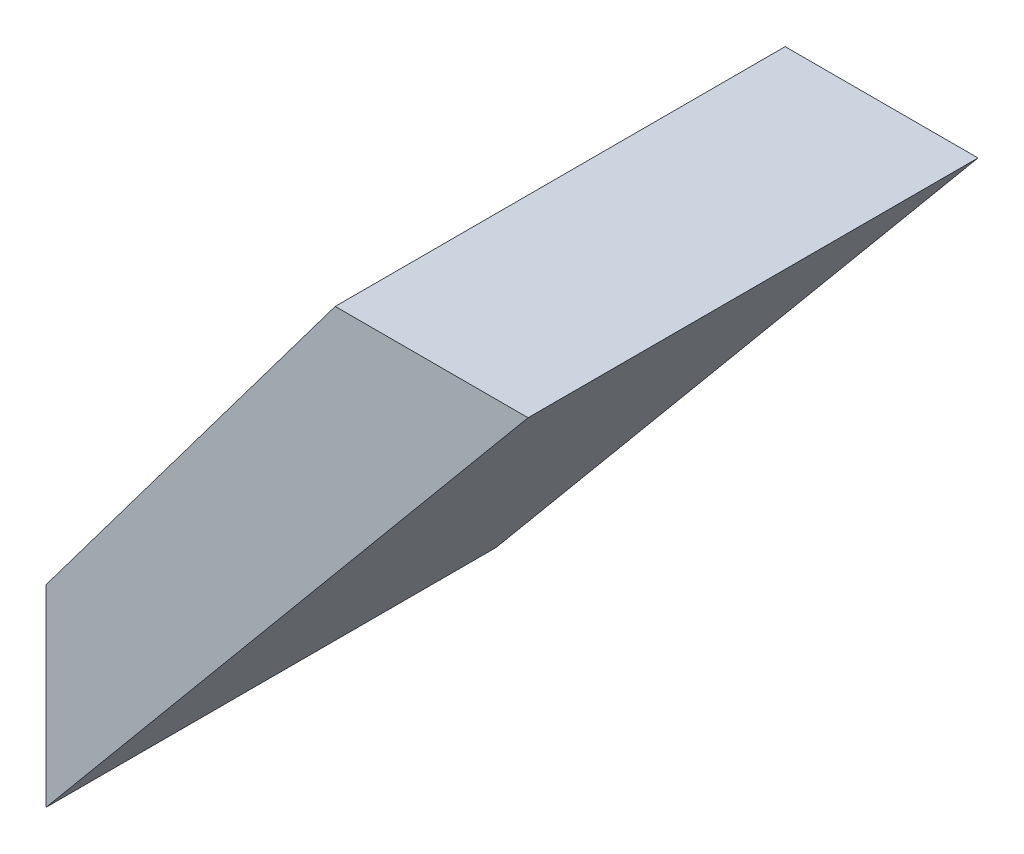
ISO-10303-21;
HEADER;
FILE_DESCRIPTION(('STEP AP214'),'2;1');
FILE_NAME('part.step','',(''),(''),'','','');
FILE_SCHEMA(('AUTOMOTIVE_DESIGN { 1 0 10303 214 1 1 1 1 }'));
ENDSEC;
DATA;
#1=APPLICATION_CONTEXT('core data for automotive mechanical design processes');
#2=APPLICATION_PROTOCOL_DEFINITION('international standard','automotive_design',2000,#1);
#3=PRODUCT_CONTEXT('',#1,'mechanical');
#4=PRODUCT('Part','Part','',(#3));
#5=PRODUCT_RELATED_PRODUCT_CATEGORY('part','',(#4));
#6=PRODUCT_DEFINITION_FORMATION('','',#4);
#7=PRODUCT_DEFINITION_CONTEXT('part definition',#1,'design');
#8=PRODUCT_DEFINITION('design','',#6,#7);
#9=PRODUCT_DEFINITION_SHAPE('','',#8);
#10=(LENGTH_UNIT() NAMED_UNIT(*) SI_UNIT(.MILLI.,.METRE.));
#11=(NAMED_UNIT(*) PLANE_ANGLE_UNIT() SI_UNIT($,.RADIAN.));
#12=(NAMED_UNIT(*) SI_UNIT($,.STERADIAN.) SOLID_ANGLE_UNIT());
#13=UNCERTAINTY_MEASURE_WITH_UNIT(LENGTH_MEASURE(1.E-05),#10,'distance_accuracy_value','');
#14=(GEOMETRIC_REPRESENTATION_CONTEXT(3) GLOBAL_UNCERTAINTY_ASSIGNED_CONTEXT((#13)) GLOBAL_UNIT_ASSIGNED_CONTEXT((#10,
#11,#12)) REPRESENTATION_CONTEXT('',''));
#15=CARTESIAN_POINT('',(0.,0.,0.));
#16=DIRECTION('',(0.,0.,1.));
#17=DIRECTION('',(1.,0.,0.));
#18=AXIS2_PLACEMENT_3D('',#15,#16,#17);
#19=CARTESIAN_POINT('',(82.55,38.1,-88.9));
#20=DIRECTION('',(-1.,0.,0.));
#21=DIRECTION('',(0.,0.,1.));
#22=AXIS2_PLACEMENT_3D('',#19,#20,#21);
#23=PLANE('',#22);
#24=DIRECTION('',(0.,-1.,0.));
#25=VECTOR('',#24,1.);
#26=CARTESIAN_POINT('',(82.55,38.1,0.));
#27=LINE('',#26,#25);
#28=CARTESIAN_POINT('',(82.55,38.1,0.));
#29=VERTEX_POINT('',#28);
#30=CARTESIAN_POINT('',(82.55,0.,0.));
#31=VERTEX_POINT('',#30);
#32=EDGE_CURVE('E96',#29,#31,#27,.T.);
#33=ORIENTED_EDGE('',*,*,#32,.F.);
#34=DIRECTION('',(0.,0.,1.));
#35=VECTOR('',#34,1.);
#36=CARTESIAN_POINT('',(82.55,38.1,-88.9));
#37=LINE('',#36,#35);
#38=CARTESIAN_POINT('',(82.55,38.1,-88.9));
#39=VERTEX_POINT('',#38);
#40=EDGE_CURVE('E11',#39,#29,#37,.T.);
#41=ORIENTED_EDGE('',*,*,#40,.F.);
#42=DIRECTION('',(0.,-1.,0.));
#43=VECTOR('',#42,1.);
#44=CARTESIAN_POINT('',(82.55,38.1,-88.9));
#45=LINE('',#44,#43);
#46=CARTESIAN_POINT('',(82.55,0.,-88.9));
#47=VERTEX_POINT('',#46);
#48=EDGE_CURVE('E90',#39,#47,#45,.T.);
#49=ORIENTED_EDGE('',*,*,#48,.T.);
#50=DIRECTION('',(0.,0.,1.));
#51=VECTOR('',#50,1.);
#52=CARTESIAN_POINT('',(82.55,0.,-88.9));
#53=LINE('',#52,#51);
#54=EDGE_CURVE('E35',#47,#31,#53,.T.);
#55=ORIENTED_EDGE('',*,*,#54,.T.);
#56=EDGE_LOOP('',(#33,#41,#49,#55));
#57=FACE_BOUND('',#56,.T.);
#58=ADVANCED_FACE('F32',(#57),#23,.T.);
#59=CARTESIAN_POINT('',(139.7,114.3,-88.9));
#60=DIRECTION('',(-0.8,0.6,0.));
#61=DIRECTION('',(-0.6,-0.8,0.));
#62=AXIS2_PLACEMENT_3D('',#59,#60,#61);
#63=PLANE('',#62);
#64=DIRECTION('',(-0.6,-0.8,0.));
#65=VECTOR('',#64,1.);
#66=CARTESIAN_POINT('',(139.7,114.3,0.));
#67=LINE('',#66,#65);
#68=CARTESIAN_POINT('',(139.7,114.3,0.));
#69=VERTEX_POINT('',#68);
#70=EDGE_CURVE('E92',#69,#29,#67,.T.);
#71=ORIENTED_EDGE('',*,*,#70,.F.);
#72=DIRECTION('',(0.,0.,1.));
#73=VECTOR('',#72,1.);
#74=CARTESIAN_POINT('',(139.7,114.3,-88.9));
#75=LINE('',#74,#73);
#76=CARTESIAN_POINT('',(139.7,114.3,-88.9));
#77=VERTEX_POINT('',#76);
#78=EDGE_CURVE('E41',#77,#69,#75,.T.);
#79=ORIENTED_EDGE('',*,*,#78,.F.);
#80=DIRECTION('',(-0.6,-0.8,0.));
#81=VECTOR('',#80,1.);
#82=CARTESIAN_POINT('',(139.7,114.3,-88.9));
#83=LINE('',#82,#81);
#84=EDGE_CURVE('E87',#77,#39,#83,.T.);
#85=ORIENTED_EDGE('',*,*,#84,.T.);
#86=ORIENTED_EDGE('',*,*,#40,.T.);
#87=EDGE_LOOP('',(#71,#79,#85,#86));
#88=FACE_BOUND('',#87,.T.);
#89=ADVANCED_FACE('F106',(#88),#63,.T.);
#90=CARTESIAN_POINT('',(177.8,114.3,-88.9));
#91=DIRECTION('',(0.,1.,0.));
#92=DIRECTION('',(0.,0.,1.));
#93=AXIS2_PLACEMENT_3D('',#90,#91,#92);
#94=PLANE('',#93);
#95=DIRECTION('',(-1.,0.,0.));
#96=VECTOR('',#95,1.);
#97=CARTESIAN_POINT('',(177.8,114.3,0.));
#98=LINE('',#97,#96);
#99=CARTESIAN_POINT('',(177.8,114.3,0.));
#100=VERTEX_POINT('',#99);
#101=EDGE_CURVE('E82',#100,#69,#98,.T.);
#102=ORIENTED_EDGE('',*,*,#101,.F.);
#103=DIRECTION('',(0.,0.,1.));
#104=VECTOR('',#103,1.);
#105=CARTESIAN_POINT('',(177.8,114.3,-88.9));
#106=LINE('',#105,#104);
#107=CARTESIAN_POINT('',(177.8,114.3,-88.9));
#108=VERTEX_POINT('',#107);
#109=EDGE_CURVE('E77',#108,#100,#106,.T.);
#110=ORIENTED_EDGE('',*,*,#109,.F.);
#111=DIRECTION('',(-1.,0.,0.));
#112=VECTOR('',#111,1.);
#113=CARTESIAN_POINT('',(177.8,114.3,-88.9));
#114=LINE('',#113,#112);
#115=EDGE_CURVE('E80',#108,#77,#114,.T.);
#116=ORIENTED_EDGE('',*,*,#115,.T.);
#117=ORIENTED_EDGE('',*,*,#78,.T.);
#118=EDGE_LOOP('',(#102,#110,#116,#117));
#119=FACE_BOUND('',#118,.T.);
#120=ADVANCED_FACE('F79',(#119),#94,.T.);
#121=CARTESIAN_POINT('',(82.55,0.,-88.9));
#122=DIRECTION('',(0.768221279597376,-0.64018439966448,0.));
#123=DIRECTION('',(0.64018439966448,0.768221279597376,0.));
#124=AXIS2_PLACEMENT_3D('',#121,#122,#123);
#125=PLANE('',#124);
#126=DIRECTION('',(0.64018439966448,0.768221279597376,0.));
#127=VECTOR('',#126,1.);
#128=CARTESIAN_POINT('',(82.55,0.,0.));
#129=LINE('',#128,#127);
#130=EDGE_CURVE('E99',#31,#100,#129,.T.);
#131=ORIENTED_EDGE('',*,*,#130,.F.);
#132=ORIENTED_EDGE('',*,*,#54,.F.);
#133=DIRECTION('',(0.64018439966448,0.768221279597376,0.));
#134=VECTOR('',#133,1.);
#135=CARTESIAN_POINT('',(82.55,0.,-88.9));
#136=LINE('',#135,#134);
#137=EDGE_CURVE('E86',#47,#108,#136,.T.);
#138=ORIENTED_EDGE('',*,*,#137,.T.);
#139=ORIENTED_EDGE('',*,*,#109,.T.);
#140=EDGE_LOOP('',(#131,#132,#138,#139));
#141=FACE_BOUND('',#140,.T.);
#142=ADVANCED_FACE('F89',(#141),#125,.T.);
#143=CARTESIAN_POINT('',(82.55,114.3,-88.9));
#144=DIRECTION('',(0.,0.,-1.));
#145=DIRECTION('',(-1.,0.,0.));
#146=AXIS2_PLACEMENT_3D('',#143,#144,#145);
#147=PLANE('',#146);
#148=ORIENTED_EDGE('',*,*,#48,.F.);
#149=ORIENTED_EDGE('',*,*,#84,.F.);
#150=ORIENTED_EDGE('',*,*,#115,.F.);
#151=ORIENTED_EDGE('',*,*,#137,.F.);
#152=EDGE_LOOP('',(#148,#149,#150,#151));
#153=FACE_BOUND('',#152,.T.);
#154=ADVANCED_FACE('F85',(#153),#147,.T.);
#155=CARTESIAN_POINT('',(82.55,114.3,0.));
#156=DIRECTION('',(0.,0.,-1.));
#157=DIRECTION('',(-1.,0.,0.));
#158=AXIS2_PLACEMENT_3D('',#155,#156,#157);
#159=PLANE('',#158);
#160=ORIENTED_EDGE('',*,*,#32,.T.);
#161=ORIENTED_EDGE('',*,*,#130,.T.);
#162=ORIENTED_EDGE('',*,*,#101,.T.);
#163=ORIENTED_EDGE('',*,*,#70,.T.);
#164=EDGE_LOOP('',(#160,#161,#162,#163));
#165=FACE_BOUND('',#164,.T.);
#166=ADVANCED_FACE('F105',(#165),#159,.F.);
#167=CLOSED_SHELL('',(#58,#89,#120,#142,#154,#166));
#168=MANIFOLD_SOLID_BREP('B2',#167);
#169=ADVANCED_BREP_SHAPE_REPRESENTATION('',(#18,#168),#14);
#170=SHAPE_DEFINITION_REPRESENTATION(#9,#169);
ENDSEC;
END-ISO-10303-21;
